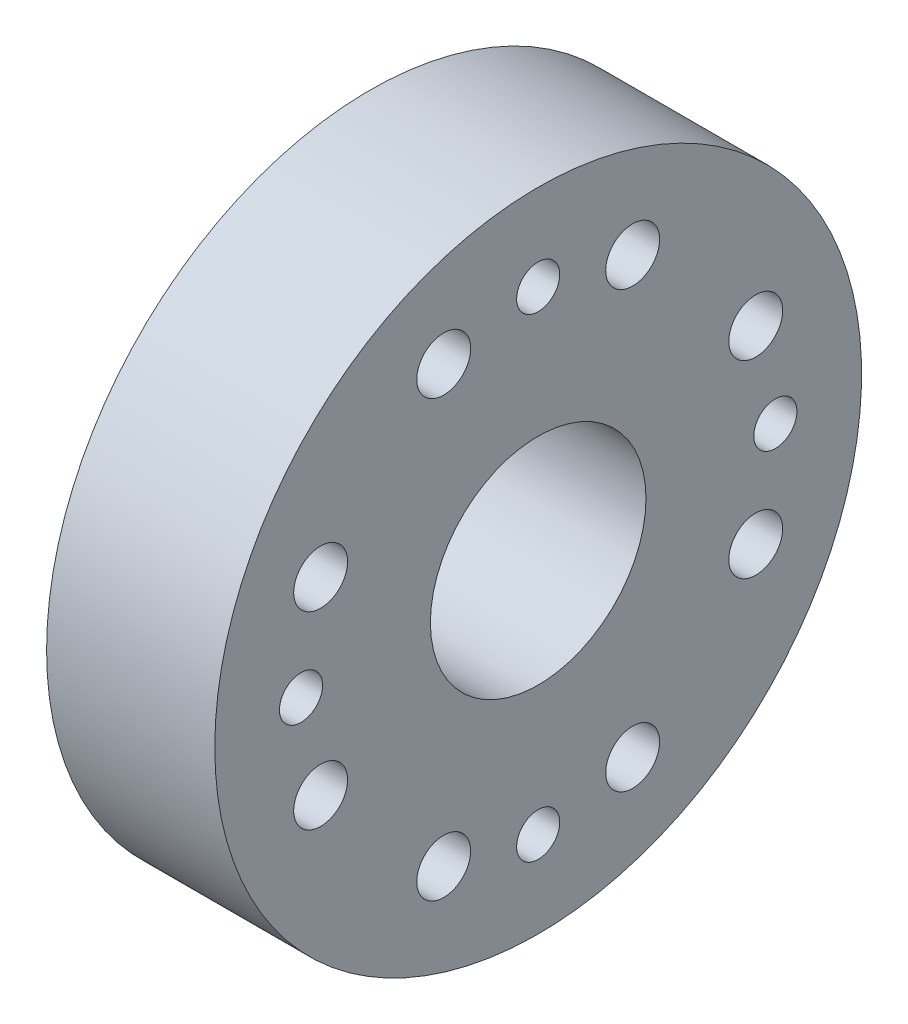
ISO-10303-21;
HEADER;
FILE_DESCRIPTION(('STEP AP214'),'2;1');
FILE_NAME('part.step','',(''),(''),'','','');
FILE_SCHEMA(('AUTOMOTIVE_DESIGN { 1 0 10303 214 1 1 1 1 }'));
ENDSEC;
DATA;
#1=APPLICATION_CONTEXT('core data for automotive mechanical design processes');
#2=APPLICATION_PROTOCOL_DEFINITION('international standard','automotive_design',2000,#1);
#3=PRODUCT_CONTEXT('',#1,'mechanical');
#4=PRODUCT('Part','Part','',(#3));
#5=PRODUCT_RELATED_PRODUCT_CATEGORY('part','',(#4));
#6=PRODUCT_DEFINITION_FORMATION('','',#4);
#7=PRODUCT_DEFINITION_CONTEXT('part definition',#1,'design');
#8=PRODUCT_DEFINITION('design','',#6,#7);
#9=PRODUCT_DEFINITION_SHAPE('','',#8);
#10=(LENGTH_UNIT() NAMED_UNIT(*) SI_UNIT(.MILLI.,.METRE.));
#11=(NAMED_UNIT(*) PLANE_ANGLE_UNIT() SI_UNIT($,.RADIAN.));
#12=(NAMED_UNIT(*) SI_UNIT($,.STERADIAN.) SOLID_ANGLE_UNIT());
#13=UNCERTAINTY_MEASURE_WITH_UNIT(LENGTH_MEASURE(1.E-05),#10,'distance_accuracy_value','');
#14=(GEOMETRIC_REPRESENTATION_CONTEXT(3) GLOBAL_UNCERTAINTY_ASSIGNED_CONTEXT((#13)) GLOBAL_UNIT_ASSIGNED_CONTEXT((#10,
#11,#12)) REPRESENTATION_CONTEXT('',''));
#15=CARTESIAN_POINT('',(0.,0.,0.));
#16=DIRECTION('',(0.,0.,1.));
#17=DIRECTION('',(1.,0.,0.));
#18=AXIS2_PLACEMENT_3D('',#15,#16,#17);
#19=CARTESIAN_POINT('',(7.8,14.,0.));
#20=DIRECTION('',(-1.,0.,0.));
#21=DIRECTION('',(0.,0.,1.));
#22=AXIS2_PLACEMENT_3D('',#19,#20,#21);
#23=PLANE('',#22);
#24=CARTESIAN_POINT('',(7.8,0.,0.));
#25=DIRECTION('',(1.,0.,0.));
#26=DIRECTION('',(0.,0.,-1.));
#27=AXIS2_PLACEMENT_3D('',#24,#25,#26);
#28=CIRCLE('',#27,5.);
#29=CARTESIAN_POINT('',(7.8,0.,-5.));
#30=VERTEX_POINT('',#29);
#31=EDGE_CURVE('E117',#30,#30,#28,.T.);
#32=ORIENTED_EDGE('',*,*,#31,.F.);
#33=EDGE_LOOP('',(#32));
#34=FACE_BOUND('',#33,.T.);
#35=CARTESIAN_POINT('',(7.8,4.38184149386817,10.0895720980929));
#36=DIRECTION('',(1.,0.,0.));
#37=DIRECTION('',(0.,0.,1.));
#38=AXIS2_PLACEMENT_3D('',#35,#36,#37);
#39=CIRCLE('',#38,1.25);
#40=CARTESIAN_POINT('',(7.8,4.38184149386817,11.3395720980929));
#41=VERTEX_POINT('',#40);
#42=EDGE_CURVE('E111',#41,#41,#39,.T.);
#43=ORIENTED_EDGE('',*,*,#42,.F.);
#44=EDGE_LOOP('',(#43));
#45=FACE_BOUND('',#44,.T.);
#46=CARTESIAN_POINT('',(7.8,-4.38184149386796,10.089572098093));
#47=DIRECTION('',(1.,0.,0.));
#48=DIRECTION('',(0.,0.,-1.));
#49=AXIS2_PLACEMENT_3D('',#46,#47,#48);
#50=CIRCLE('',#49,1.25);
#51=CARTESIAN_POINT('',(7.8,-4.38184149386796,8.83957209809301));
#52=VERTEX_POINT('',#51);
#53=EDGE_CURVE('E105',#52,#52,#50,.T.);
#54=ORIENTED_EDGE('',*,*,#53,.F.);
#55=EDGE_LOOP('',(#54));
#56=FACE_BOUND('',#55,.T.);
#57=CARTESIAN_POINT('',(7.8,1.1521895091661E-13,11.));
#58=DIRECTION('',(1.,0.,0.));
#59=DIRECTION('',(0.,0.,-1.));
#60=AXIS2_PLACEMENT_3D('',#57,#58,#59);
#61=CIRCLE('',#60,1.);
#62=CARTESIAN_POINT('',(7.8,1.1521895091661E-13,10.));
#63=VERTEX_POINT('',#62);
#64=EDGE_CURVE('E99',#63,#63,#61,.T.);
#65=ORIENTED_EDGE('',*,*,#64,.F.);
#66=EDGE_LOOP('',(#65));
#67=FACE_BOUND('',#66,.T.);
#68=CARTESIAN_POINT('',(7.8,-10.0895720980929,4.38184149386814));
#69=DIRECTION('',(1.,0.,0.));
#70=DIRECTION('',(0.,0.,1.));
#71=AXIS2_PLACEMENT_3D('',#68,#69,#70);
#72=CIRCLE('',#71,1.25);
#73=CARTESIAN_POINT('',(7.8,-10.0895720980929,5.63184149386814));
#74=VERTEX_POINT('',#73);
#75=EDGE_CURVE('E93',#74,#74,#72,.T.);
#76=ORIENTED_EDGE('',*,*,#75,.F.);
#77=EDGE_LOOP('',(#76));
#78=FACE_BOUND('',#77,.T.);
#79=CARTESIAN_POINT('',(7.8,-10.089572098093,-4.381841493868));
#80=DIRECTION('',(1.,0.,0.));
#81=DIRECTION('',(0.,0.,-1.));
#82=AXIS2_PLACEMENT_3D('',#79,#80,#81);
#83=CIRCLE('',#82,1.25);
#84=CARTESIAN_POINT('',(7.8,-10.089572098093,-5.631841493868));
#85=VERTEX_POINT('',#84);
#86=EDGE_CURVE('E87',#85,#85,#83,.T.);
#87=ORIENTED_EDGE('',*,*,#86,.F.);
#88=EDGE_LOOP('',(#87));
#89=FACE_BOUND('',#88,.T.);
#90=CARTESIAN_POINT('',(7.8,-11.,0.));
#91=DIRECTION('',(1.,0.,0.));
#92=DIRECTION('',(0.,0.,-1.));
#93=AXIS2_PLACEMENT_3D('',#90,#91,#92);
#94=CIRCLE('',#93,1.);
#95=CARTESIAN_POINT('',(7.8,-11.,-0.999999999999924));
#96=VERTEX_POINT('',#95);
#97=EDGE_CURVE('E81',#96,#96,#94,.T.);
#98=ORIENTED_EDGE('',*,*,#97,.F.);
#99=EDGE_LOOP('',(#98));
#100=FACE_BOUND('',#99,.T.);
#101=CARTESIAN_POINT('',(7.8,-4.3818414938681,-10.0895720980929));
#102=DIRECTION('',(1.,0.,0.));
#103=DIRECTION('',(0.,0.,1.));
#104=AXIS2_PLACEMENT_3D('',#101,#102,#103);
#105=CIRCLE('',#104,1.25);
#106=CARTESIAN_POINT('',(7.8,-4.3818414938681,-8.83957209809292));
#107=VERTEX_POINT('',#106);
#108=EDGE_CURVE('E75',#107,#107,#105,.T.);
#109=ORIENTED_EDGE('',*,*,#108,.F.);
#110=EDGE_LOOP('',(#109));
#111=FACE_BOUND('',#110,.T.);
#112=CARTESIAN_POINT('',(7.8,4.38184149386803,-10.089572098093));
#113=DIRECTION('',(1.,0.,0.));
#114=DIRECTION('',(0.,0.,-1.));
#115=AXIS2_PLACEMENT_3D('',#112,#113,#114);
#116=CIRCLE('',#115,1.25);
#117=CARTESIAN_POINT('',(7.8,4.38184149386803,-11.339572098093));
#118=VERTEX_POINT('',#117);
#119=EDGE_CURVE('E69',#118,#118,#116,.T.);
#120=ORIENTED_EDGE('',*,*,#119,.F.);
#121=EDGE_LOOP('',(#120));
#122=FACE_BOUND('',#121,.T.);
#123=CARTESIAN_POINT('',(7.8,0.,-11.));
#124=DIRECTION('',(1.,0.,0.));
#125=DIRECTION('',(0.,0.,-1.));
#126=AXIS2_PLACEMENT_3D('',#123,#124,#125);
#127=CIRCLE('',#126,1.);
#128=CARTESIAN_POINT('',(7.8,0.,-12.));
#129=VERTEX_POINT('',#128);
#130=EDGE_CURVE('E63',#129,#129,#127,.T.);
#131=ORIENTED_EDGE('',*,*,#130,.F.);
#132=EDGE_LOOP('',(#131));
#133=FACE_BOUND('',#132,.T.);
#134=CARTESIAN_POINT('',(7.8,10.0895720980929,-4.38184149386807));
#135=DIRECTION('',(1.,0.,0.));
#136=DIRECTION('',(0.,0.,1.));
#137=AXIS2_PLACEMENT_3D('',#134,#135,#136);
#138=CIRCLE('',#137,1.25);
#139=CARTESIAN_POINT('',(7.8,10.0895720980929,-3.13184149386807));
#140=VERTEX_POINT('',#139);
#141=EDGE_CURVE('E57',#140,#140,#138,.T.);
#142=ORIENTED_EDGE('',*,*,#141,.F.);
#143=EDGE_LOOP('',(#142));
#144=FACE_BOUND('',#143,.T.);
#145=CARTESIAN_POINT('',(7.8,10.089572098093,4.38184149386807));
#146=DIRECTION('',(1.,0.,0.));
#147=DIRECTION('',(0.,0.,-1.));
#148=AXIS2_PLACEMENT_3D('',#145,#146,#147);
#149=CIRCLE('',#148,1.25);
#150=CARTESIAN_POINT('',(7.8,10.089572098093,3.13184149386807));
#151=VERTEX_POINT('',#150);
#152=EDGE_CURVE('E51',#151,#151,#149,.T.);
#153=ORIENTED_EDGE('',*,*,#152,.F.);
#154=EDGE_LOOP('',(#153));
#155=FACE_BOUND('',#154,.T.);
#156=CARTESIAN_POINT('',(7.8,11.,0.));
#157=DIRECTION('',(1.,0.,0.));
#158=DIRECTION('',(0.,0.,-1.));
#159=AXIS2_PLACEMENT_3D('',#156,#157,#158);
#160=CIRCLE('',#159,1.);
#161=CARTESIAN_POINT('',(7.8,11.,-1.));
#162=VERTEX_POINT('',#161);
#163=EDGE_CURVE('E45',#162,#162,#160,.T.);
#164=ORIENTED_EDGE('',*,*,#163,.F.);
#165=EDGE_LOOP('',(#164));
#166=FACE_BOUND('',#165,.T.);
#167=CARTESIAN_POINT('',(7.8,0.,0.));
#168=DIRECTION('',(-1.,0.,0.));
#169=DIRECTION('',(0.,0.,1.));
#170=AXIS2_PLACEMENT_3D('',#167,#168,#169);
#171=CIRCLE('',#170,15.);
#172=CARTESIAN_POINT('',(7.8,0.,15.));
#173=VERTEX_POINT('',#172);
#174=EDGE_CURVE('E10',#173,#173,#171,.T.);
#175=ORIENTED_EDGE('',*,*,#174,.F.);
#176=EDGE_LOOP('',(#175));
#177=FACE_BOUND('',#176,.T.);
#178=ADVANCED_FACE('F31',(#34,#45,#56,#67,#78,#89,#100,#111,#122,#133,#144,#155,#166,#177),#23,.F.);
#179=CARTESIAN_POINT('',(0.,0.,0.));
#180=DIRECTION('',(-1.,0.,0.));
#181=DIRECTION('',(0.,0.,1.));
#182=AXIS2_PLACEMENT_3D('',#179,#180,#181);
#183=CYLINDRICAL_SURFACE('',#182,15.);
#184=CARTESIAN_POINT('',(0.,0.,0.));
#185=DIRECTION('',(-1.,0.,0.));
#186=DIRECTION('',(0.,0.,1.));
#187=AXIS2_PLACEMENT_3D('',#184,#185,#186);
#188=CIRCLE('',#187,15.);
#189=CARTESIAN_POINT('',(0.,0.,15.));
#190=VERTEX_POINT('',#189);
#191=EDGE_CURVE('E37',#190,#190,#188,.T.);
#192=ORIENTED_EDGE('',*,*,#191,.F.);
#193=EDGE_LOOP('',(#192));
#194=FACE_BOUND('',#193,.T.);
#195=ORIENTED_EDGE('',*,*,#174,.T.);
#196=EDGE_LOOP('',(#195));
#197=FACE_BOUND('',#196,.T.);
#198=ADVANCED_FACE('F135',(#194,#197),#183,.T.);
#199=CARTESIAN_POINT('',(0.,15.,0.));
#200=DIRECTION('',(1.,0.,0.));
#201=DIRECTION('',(0.,0.,-1.));
#202=AXIS2_PLACEMENT_3D('',#199,#200,#201);
#203=PLANE('',#202);
#204=CARTESIAN_POINT('',(0.,0.,0.));
#205=DIRECTION('',(1.,0.,0.));
#206=DIRECTION('',(0.,0.,-1.));
#207=AXIS2_PLACEMENT_3D('',#204,#205,#206);
#208=CIRCLE('',#207,5.);
#209=CARTESIAN_POINT('',(0.,0.,-5.));
#210=VERTEX_POINT('',#209);
#211=EDGE_CURVE('E114',#210,#210,#208,.T.);
#212=ORIENTED_EDGE('',*,*,#211,.T.);
#213=EDGE_LOOP('',(#212));
#214=FACE_BOUND('',#213,.T.);
#215=CARTESIAN_POINT('',(0.,4.38184149386817,10.0895720980929));
#216=DIRECTION('',(1.,0.,0.));
#217=DIRECTION('',(0.,0.,1.));
#218=AXIS2_PLACEMENT_3D('',#215,#216,#217);
#219=CIRCLE('',#218,1.25);
#220=CARTESIAN_POINT('',(0.,4.38184149386817,11.3395720980929));
#221=VERTEX_POINT('',#220);
#222=EDGE_CURVE('E108',#221,#221,#219,.T.);
#223=ORIENTED_EDGE('',*,*,#222,.T.);
#224=EDGE_LOOP('',(#223));
#225=FACE_BOUND('',#224,.T.);
#226=CARTESIAN_POINT('',(0.,-4.38184149386796,10.089572098093));
#227=DIRECTION('',(1.,0.,0.));
#228=DIRECTION('',(0.,0.,-1.));
#229=AXIS2_PLACEMENT_3D('',#226,#227,#228);
#230=CIRCLE('',#229,1.25);
#231=CARTESIAN_POINT('',(0.,-4.38184149386796,8.83957209809301));
#232=VERTEX_POINT('',#231);
#233=EDGE_CURVE('E102',#232,#232,#230,.T.);
#234=ORIENTED_EDGE('',*,*,#233,.T.);
#235=EDGE_LOOP('',(#234));
#236=FACE_BOUND('',#235,.T.);
#237=CARTESIAN_POINT('',(0.,1.1521895091661E-13,11.));
#238=DIRECTION('',(1.,0.,0.));
#239=DIRECTION('',(0.,0.,-1.));
#240=AXIS2_PLACEMENT_3D('',#237,#238,#239);
#241=CIRCLE('',#240,1.);
#242=CARTESIAN_POINT('',(0.,1.1521895091661E-13,10.));
#243=VERTEX_POINT('',#242);
#244=EDGE_CURVE('E96',#243,#243,#241,.T.);
#245=ORIENTED_EDGE('',*,*,#244,.T.);
#246=EDGE_LOOP('',(#245));
#247=FACE_BOUND('',#246,.T.);
#248=CARTESIAN_POINT('',(0.,-10.0895720980929,4.38184149386814));
#249=DIRECTION('',(1.,0.,0.));
#250=DIRECTION('',(0.,0.,1.));
#251=AXIS2_PLACEMENT_3D('',#248,#249,#250);
#252=CIRCLE('',#251,1.25);
#253=CARTESIAN_POINT('',(0.,-10.0895720980929,5.63184149386814));
#254=VERTEX_POINT('',#253);
#255=EDGE_CURVE('E90',#254,#254,#252,.T.);
#256=ORIENTED_EDGE('',*,*,#255,.T.);
#257=EDGE_LOOP('',(#256));
#258=FACE_BOUND('',#257,.T.);
#259=CARTESIAN_POINT('',(0.,-10.089572098093,-4.381841493868));
#260=DIRECTION('',(1.,0.,0.));
#261=DIRECTION('',(0.,0.,-1.));
#262=AXIS2_PLACEMENT_3D('',#259,#260,#261);
#263=CIRCLE('',#262,1.25);
#264=CARTESIAN_POINT('',(0.,-10.089572098093,-5.631841493868));
#265=VERTEX_POINT('',#264);
#266=EDGE_CURVE('E84',#265,#265,#263,.T.);
#267=ORIENTED_EDGE('',*,*,#266,.T.);
#268=EDGE_LOOP('',(#267));
#269=FACE_BOUND('',#268,.T.);
#270=CARTESIAN_POINT('',(0.,-11.,0.));
#271=DIRECTION('',(1.,0.,0.));
#272=DIRECTION('',(0.,0.,-1.));
#273=AXIS2_PLACEMENT_3D('',#270,#271,#272);
#274=CIRCLE('',#273,1.);
#275=CARTESIAN_POINT('',(0.,-11.,-0.999999999999924));
#276=VERTEX_POINT('',#275);
#277=EDGE_CURVE('E78',#276,#276,#274,.T.);
#278=ORIENTED_EDGE('',*,*,#277,.T.);
#279=EDGE_LOOP('',(#278));
#280=FACE_BOUND('',#279,.T.);
#281=CARTESIAN_POINT('',(0.,-4.3818414938681,-10.0895720980929));
#282=DIRECTION('',(1.,0.,0.));
#283=DIRECTION('',(0.,0.,1.));
#284=AXIS2_PLACEMENT_3D('',#281,#282,#283);
#285=CIRCLE('',#284,1.25);
#286=CARTESIAN_POINT('',(0.,-4.3818414938681,-8.83957209809292));
#287=VERTEX_POINT('',#286);
#288=EDGE_CURVE('E72',#287,#287,#285,.T.);
#289=ORIENTED_EDGE('',*,*,#288,.T.);
#290=EDGE_LOOP('',(#289));
#291=FACE_BOUND('',#290,.T.);
#292=CARTESIAN_POINT('',(0.,4.38184149386803,-10.089572098093));
#293=DIRECTION('',(1.,0.,0.));
#294=DIRECTION('',(0.,0.,-1.));
#295=AXIS2_PLACEMENT_3D('',#292,#293,#294);
#296=CIRCLE('',#295,1.25);
#297=CARTESIAN_POINT('',(0.,4.38184149386803,-11.339572098093));
#298=VERTEX_POINT('',#297);
#299=EDGE_CURVE('E66',#298,#298,#296,.T.);
#300=ORIENTED_EDGE('',*,*,#299,.T.);
#301=EDGE_LOOP('',(#300));
#302=FACE_BOUND('',#301,.T.);
#303=CARTESIAN_POINT('',(0.,0.,-11.));
#304=DIRECTION('',(1.,0.,0.));
#305=DIRECTION('',(0.,0.,-1.));
#306=AXIS2_PLACEMENT_3D('',#303,#304,#305);
#307=CIRCLE('',#306,1.);
#308=CARTESIAN_POINT('',(0.,0.,-12.));
#309=VERTEX_POINT('',#308);
#310=EDGE_CURVE('E60',#309,#309,#307,.T.);
#311=ORIENTED_EDGE('',*,*,#310,.T.);
#312=EDGE_LOOP('',(#311));
#313=FACE_BOUND('',#312,.T.);
#314=CARTESIAN_POINT('',(0.,10.0895720980929,-4.38184149386807));
#315=DIRECTION('',(1.,0.,0.));
#316=DIRECTION('',(0.,0.,1.));
#317=AXIS2_PLACEMENT_3D('',#314,#315,#316);
#318=CIRCLE('',#317,1.25);
#319=CARTESIAN_POINT('',(0.,10.0895720980929,-3.13184149386807));
#320=VERTEX_POINT('',#319);
#321=EDGE_CURVE('E54',#320,#320,#318,.T.);
#322=ORIENTED_EDGE('',*,*,#321,.T.);
#323=EDGE_LOOP('',(#322));
#324=FACE_BOUND('',#323,.T.);
#325=CARTESIAN_POINT('',(0.,10.089572098093,4.38184149386807));
#326=DIRECTION('',(1.,0.,0.));
#327=DIRECTION('',(0.,0.,-1.));
#328=AXIS2_PLACEMENT_3D('',#325,#326,#327);
#329=CIRCLE('',#328,1.25);
#330=CARTESIAN_POINT('',(0.,10.089572098093,3.13184149386807));
#331=VERTEX_POINT('',#330);
#332=EDGE_CURVE('E49',#331,#331,#329,.T.);
#333=ORIENTED_EDGE('',*,*,#332,.T.);
#334=EDGE_LOOP('',(#333));
#335=FACE_BOUND('',#334,.T.);
#336=CARTESIAN_POINT('',(0.,11.,0.));
#337=DIRECTION('',(1.,0.,0.));
#338=DIRECTION('',(0.,0.,-1.));
#339=AXIS2_PLACEMENT_3D('',#336,#337,#338);
#340=CIRCLE('',#339,1.);
#341=CARTESIAN_POINT('',(0.,11.,-1.));
#342=VERTEX_POINT('',#341);
#343=EDGE_CURVE('E41',#342,#342,#340,.T.);
#344=ORIENTED_EDGE('',*,*,#343,.T.);
#345=EDGE_LOOP('',(#344));
#346=FACE_BOUND('',#345,.T.);
#347=ORIENTED_EDGE('',*,*,#191,.T.);
#348=EDGE_LOOP('',(#347));
#349=FACE_BOUND('',#348,.T.);
#350=ADVANCED_FACE('F123',(#214,#225,#236,#247,#258,#269,#280,#291,#302,#313,#324,#335,#346,
#349),#203,.F.);
#351=CARTESIAN_POINT('',(0.,11.,0.));
#352=DIRECTION('',(1.,0.,0.));
#353=DIRECTION('',(0.,0.,-1.));
#354=AXIS2_PLACEMENT_3D('',#351,#352,#353);
#355=CYLINDRICAL_SURFACE('',#354,1.);
#356=ORIENTED_EDGE('',*,*,#343,.F.);
#357=EDGE_LOOP('',(#356));
#358=FACE_BOUND('',#357,.T.);
#359=ORIENTED_EDGE('',*,*,#163,.T.);
#360=EDGE_LOOP('',(#359));
#361=FACE_BOUND('',#360,.T.);
#362=ADVANCED_FACE('F161',(#358,#361),#355,.F.);
#363=CARTESIAN_POINT('',(0.,10.089572098093,4.38184149386807));
#364=DIRECTION('',(1.,0.,0.));
#365=DIRECTION('',(0.,0.,-1.));
#366=AXIS2_PLACEMENT_3D('',#363,#364,#365);
#367=CYLINDRICAL_SURFACE('',#366,1.25);
#368=ORIENTED_EDGE('',*,*,#332,.F.);
#369=EDGE_LOOP('',(#368));
#370=FACE_BOUND('',#369,.T.);
#371=ORIENTED_EDGE('',*,*,#152,.T.);
#372=EDGE_LOOP('',(#371));
#373=FACE_BOUND('',#372,.T.);
#374=ADVANCED_FACE('F163',(#370,#373),#367,.F.);
#375=CARTESIAN_POINT('',(0.,10.0895720980929,-4.38184149386807));
#376=DIRECTION('',(1.,0.,0.));
#377=DIRECTION('',(0.,0.,-1.));
#378=AXIS2_PLACEMENT_3D('',#375,#376,#377);
#379=CYLINDRICAL_SURFACE('',#378,1.25);
#380=ORIENTED_EDGE('',*,*,#321,.F.);
#381=EDGE_LOOP('',(#380));
#382=FACE_BOUND('',#381,.T.);
#383=ORIENTED_EDGE('',*,*,#141,.T.);
#384=EDGE_LOOP('',(#383));
#385=FACE_BOUND('',#384,.T.);
#386=ADVANCED_FACE('F170',(#382,#385),#379,.F.);
#387=CARTESIAN_POINT('',(0.,0.,-11.));
#388=DIRECTION('',(1.,0.,0.));
#389=DIRECTION('',(0.,0.,-1.));
#390=AXIS2_PLACEMENT_3D('',#387,#388,#389);
#391=CYLINDRICAL_SURFACE('',#390,1.);
#392=ORIENTED_EDGE('',*,*,#310,.F.);
#393=EDGE_LOOP('',(#392));
#394=FACE_BOUND('',#393,.T.);
#395=ORIENTED_EDGE('',*,*,#130,.T.);
#396=EDGE_LOOP('',(#395));
#397=FACE_BOUND('',#396,.T.);
#398=ADVANCED_FACE('F260',(#394,#397),#391,.F.);
#399=CARTESIAN_POINT('',(0.,4.38184149386803,-10.089572098093));
#400=DIRECTION('',(1.,0.,0.));
#401=DIRECTION('',(0.,0.,-1.));
#402=AXIS2_PLACEMENT_3D('',#399,#400,#401);
#403=CYLINDRICAL_SURFACE('',#402,1.25);
#404=ORIENTED_EDGE('',*,*,#299,.F.);
#405=EDGE_LOOP('',(#404));
#406=FACE_BOUND('',#405,.T.);
#407=ORIENTED_EDGE('',*,*,#119,.T.);
#408=EDGE_LOOP('',(#407));
#409=FACE_BOUND('',#408,.T.);
#410=ADVANCED_FACE('F252',(#406,#409),#403,.F.);
#411=CARTESIAN_POINT('',(0.,-4.3818414938681,-10.0895720980929));
#412=DIRECTION('',(1.,0.,0.));
#413=DIRECTION('',(0.,0.,-1.));
#414=AXIS2_PLACEMENT_3D('',#411,#412,#413);
#415=CYLINDRICAL_SURFACE('',#414,1.25);
#416=ORIENTED_EDGE('',*,*,#288,.F.);
#417=EDGE_LOOP('',(#416));
#418=FACE_BOUND('',#417,.T.);
#419=ORIENTED_EDGE('',*,*,#108,.T.);
#420=EDGE_LOOP('',(#419));
#421=FACE_BOUND('',#420,.T.);
#422=ADVANCED_FACE('F244',(#418,#421),#415,.F.);
#423=CARTESIAN_POINT('',(0.,-11.,0.));
#424=DIRECTION('',(1.,0.,0.));
#425=DIRECTION('',(0.,0.,-1.));
#426=AXIS2_PLACEMENT_3D('',#423,#424,#425);
#427=CYLINDRICAL_SURFACE('',#426,1.);
#428=ORIENTED_EDGE('',*,*,#277,.F.);
#429=EDGE_LOOP('',(#428));
#430=FACE_BOUND('',#429,.T.);
#431=ORIENTED_EDGE('',*,*,#97,.T.);
#432=EDGE_LOOP('',(#431));
#433=FACE_BOUND('',#432,.T.);
#434=ADVANCED_FACE('F236',(#430,#433),#427,.F.);
#435=CARTESIAN_POINT('',(0.,-10.089572098093,-4.381841493868));
#436=DIRECTION('',(1.,0.,0.));
#437=DIRECTION('',(0.,0.,-1.));
#438=AXIS2_PLACEMENT_3D('',#435,#436,#437);
#439=CYLINDRICAL_SURFACE('',#438,1.25);
#440=ORIENTED_EDGE('',*,*,#266,.F.);
#441=EDGE_LOOP('',(#440));
#442=FACE_BOUND('',#441,.T.);
#443=ORIENTED_EDGE('',*,*,#86,.T.);
#444=EDGE_LOOP('',(#443));
#445=FACE_BOUND('',#444,.T.);
#446=ADVANCED_FACE('F228',(#442,#445),#439,.F.);
#447=CARTESIAN_POINT('',(0.,-10.0895720980929,4.38184149386814));
#448=DIRECTION('',(1.,0.,0.));
#449=DIRECTION('',(0.,0.,-1.));
#450=AXIS2_PLACEMENT_3D('',#447,#448,#449);
#451=CYLINDRICAL_SURFACE('',#450,1.25);
#452=ORIENTED_EDGE('',*,*,#255,.F.);
#453=EDGE_LOOP('',(#452));
#454=FACE_BOUND('',#453,.T.);
#455=ORIENTED_EDGE('',*,*,#75,.T.);
#456=EDGE_LOOP('',(#455));
#457=FACE_BOUND('',#456,.T.);
#458=ADVANCED_FACE('F220',(#454,#457),#451,.F.);
#459=CARTESIAN_POINT('',(0.,1.1521895091661E-13,11.));
#460=DIRECTION('',(1.,0.,0.));
#461=DIRECTION('',(0.,0.,-1.));
#462=AXIS2_PLACEMENT_3D('',#459,#460,#461);
#463=CYLINDRICAL_SURFACE('',#462,1.);
#464=ORIENTED_EDGE('',*,*,#244,.F.);
#465=EDGE_LOOP('',(#464));
#466=FACE_BOUND('',#465,.T.);
#467=ORIENTED_EDGE('',*,*,#64,.T.);
#468=EDGE_LOOP('',(#467));
#469=FACE_BOUND('',#468,.T.);
#470=ADVANCED_FACE('F212',(#466,#469),#463,.F.);
#471=CARTESIAN_POINT('',(0.,-4.38184149386796,10.089572098093));
#472=DIRECTION('',(1.,0.,0.));
#473=DIRECTION('',(0.,0.,-1.));
#474=AXIS2_PLACEMENT_3D('',#471,#472,#473);
#475=CYLINDRICAL_SURFACE('',#474,1.25);
#476=ORIENTED_EDGE('',*,*,#233,.F.);
#477=EDGE_LOOP('',(#476));
#478=FACE_BOUND('',#477,.T.);
#479=ORIENTED_EDGE('',*,*,#53,.T.);
#480=EDGE_LOOP('',(#479));
#481=FACE_BOUND('',#480,.T.);
#482=ADVANCED_FACE('F205',(#478,#481),#475,.F.);
#483=CARTESIAN_POINT('',(0.,4.38184149386817,10.0895720980929));
#484=DIRECTION('',(1.,0.,0.));
#485=DIRECTION('',(0.,0.,-1.));
#486=AXIS2_PLACEMENT_3D('',#483,#484,#485);
#487=CYLINDRICAL_SURFACE('',#486,1.25);
#488=ORIENTED_EDGE('',*,*,#222,.F.);
#489=EDGE_LOOP('',(#488));
#490=FACE_BOUND('',#489,.T.);
#491=ORIENTED_EDGE('',*,*,#42,.T.);
#492=EDGE_LOOP('',(#491));
#493=FACE_BOUND('',#492,.T.);
#494=ADVANCED_FACE('F129',(#490,#493),#487,.F.);
#495=CARTESIAN_POINT('',(0.,0.,0.));
#496=DIRECTION('',(1.,0.,0.));
#497=DIRECTION('',(0.,0.,-1.));
#498=AXIS2_PLACEMENT_3D('',#495,#496,#497);
#499=CYLINDRICAL_SURFACE('',#498,5.);
#500=ORIENTED_EDGE('',*,*,#211,.F.);
#501=EDGE_LOOP('',(#500));
#502=FACE_BOUND('',#501,.T.);
#503=ORIENTED_EDGE('',*,*,#31,.T.);
#504=EDGE_LOOP('',(#503));
#505=FACE_BOUND('',#504,.T.);
#506=ADVANCED_FACE('F126',(#502,#505),#499,.F.);
#507=CLOSED_SHELL('',(#178,#198,#350,#362,#374,#386,#398,#410,#422,#434,#446,#458,#470,#482,
#494,#506));
#508=MANIFOLD_SOLID_BREP('B2',#507);
#509=ADVANCED_BREP_SHAPE_REPRESENTATION('',(#18,#508),#14);
#510=SHAPE_DEFINITION_REPRESENTATION(#9,#509);
ENDSEC;
END-ISO-10303-21;
